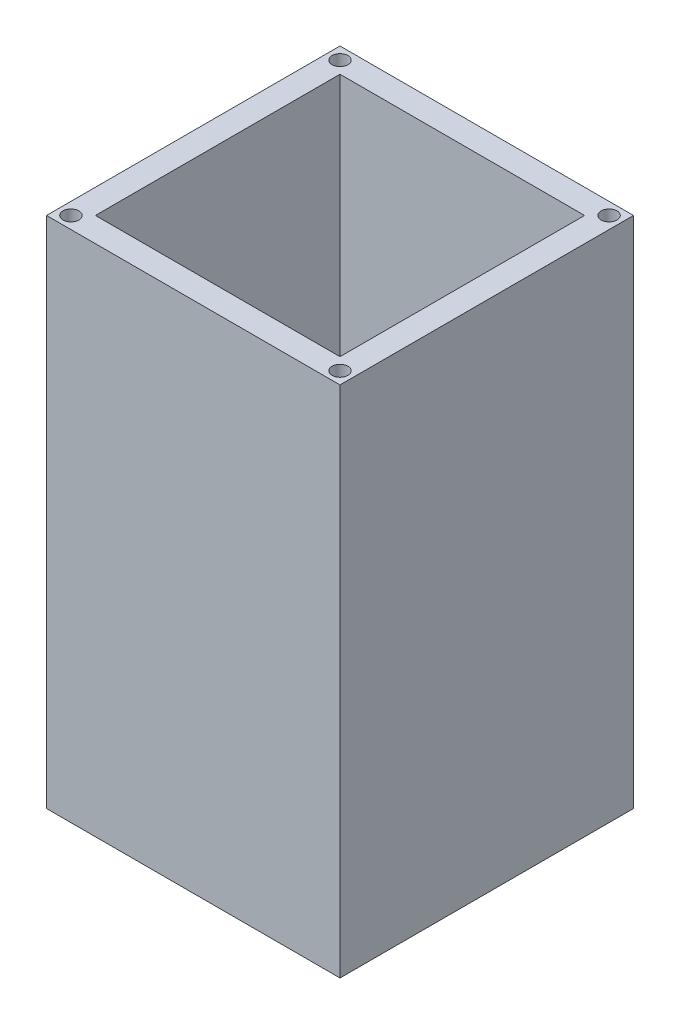
ISO-10303-21;
HEADER;
FILE_DESCRIPTION(('STEP AP214'),'2;1');
FILE_NAME('part.step','',(''),(''),'','','');
FILE_SCHEMA(('AUTOMOTIVE_DESIGN { 1 0 10303 214 1 1 1 1 }'));
ENDSEC;
DATA;
#1=APPLICATION_CONTEXT('core data for automotive mechanical design processes');
#2=APPLICATION_PROTOCOL_DEFINITION('international standard','automotive_design',2000,#1);
#3=PRODUCT_CONTEXT('',#1,'mechanical');
#4=PRODUCT('Part','Part','',(#3));
#5=PRODUCT_RELATED_PRODUCT_CATEGORY('part','',(#4));
#6=PRODUCT_DEFINITION_FORMATION('','',#4);
#7=PRODUCT_DEFINITION_CONTEXT('part definition',#1,'design');
#8=PRODUCT_DEFINITION('design','',#6,#7);
#9=PRODUCT_DEFINITION_SHAPE('','',#8);
#10=(LENGTH_UNIT() NAMED_UNIT(*) SI_UNIT(.MILLI.,.METRE.));
#11=(NAMED_UNIT(*) PLANE_ANGLE_UNIT() SI_UNIT($,.RADIAN.));
#12=(NAMED_UNIT(*) SI_UNIT($,.STERADIAN.) SOLID_ANGLE_UNIT());
#13=UNCERTAINTY_MEASURE_WITH_UNIT(LENGTH_MEASURE(1.E-05),#10,'distance_accuracy_value','');
#14=(GEOMETRIC_REPRESENTATION_CONTEXT(3) GLOBAL_UNCERTAINTY_ASSIGNED_CONTEXT((#13)) GLOBAL_UNIT_ASSIGNED_CONTEXT((#10,
#11,#12)) REPRESENTATION_CONTEXT('',''));
#15=CARTESIAN_POINT('',(0.,0.,0.));
#16=DIRECTION('',(0.,0.,1.));
#17=DIRECTION('',(1.,0.,0.));
#18=AXIS2_PLACEMENT_3D('',#15,#16,#17);
#19=CARTESIAN_POINT('',(0.,10.,0.));
#20=DIRECTION('',(0.,-1.,0.));
#21=DIRECTION('',(0.,0.,-1.));
#22=AXIS2_PLACEMENT_3D('',#19,#20,#21);
#23=PLANE('',#22);
#24=CARTESIAN_POINT('',(60.,10.,-60.));
#25=DIRECTION('',(0.,1.,0.));
#26=DIRECTION('',(0.,0.,1.));
#27=AXIS2_PLACEMENT_3D('',#24,#25,#26);
#28=CIRCLE('',#27,7.50000000000001);
#29=CARTESIAN_POINT('',(60.,10.,-52.5));
#30=VERTEX_POINT('',#29);
#31=EDGE_CURVE('E315',#30,#30,#28,.T.);
#32=ORIENTED_EDGE('',*,*,#31,.F.);
#33=EDGE_LOOP('',(#32));
#34=FACE_BOUND('',#33,.T.);
#35=DIRECTION('',(0.,0.,1.));
#36=VECTOR('',#35,1.);
#37=CARTESIAN_POINT('',(10.,10.,-110.));
#38=LINE('',#37,#36);
#39=CARTESIAN_POINT('',(10.,10.,-110.));
#40=VERTEX_POINT('',#39);
#41=CARTESIAN_POINT('',(10.,10.,-10.));
#42=VERTEX_POINT('',#41);
#43=EDGE_CURVE('E290',#40,#42,#38,.T.);
#44=ORIENTED_EDGE('',*,*,#43,.T.);
#45=DIRECTION('',(1.,0.,0.));
#46=VECTOR('',#45,1.);
#47=CARTESIAN_POINT('',(10.,10.,-10.));
#48=LINE('',#47,#46);
#49=CARTESIAN_POINT('',(110.,10.,-10.));
#50=VERTEX_POINT('',#49);
#51=EDGE_CURVE('E259',#42,#50,#48,.T.);
#52=ORIENTED_EDGE('',*,*,#51,.T.);
#53=DIRECTION('',(0.,0.,-1.));
#54=VECTOR('',#53,1.);
#55=CARTESIAN_POINT('',(110.,10.,-10.));
#56=LINE('',#55,#54);
#57=CARTESIAN_POINT('',(110.,10.,-110.));
#58=VERTEX_POINT('',#57);
#59=EDGE_CURVE('E205',#50,#58,#56,.T.);
#60=ORIENTED_EDGE('',*,*,#59,.T.);
#61=DIRECTION('',(-1.,0.,0.));
#62=VECTOR('',#61,1.);
#63=CARTESIAN_POINT('',(110.,10.,-110.));
#64=LINE('',#63,#62);
#65=EDGE_CURVE('E200',#58,#40,#64,.T.);
#66=ORIENTED_EDGE('',*,*,#65,.T.);
#67=EDGE_LOOP('',(#44,#52,#60,#66));
#68=FACE_BOUND('',#67,.T.);
#69=ADVANCED_FACE('F184',(#34,#68),#23,.F.);
#70=CARTESIAN_POINT('',(0.,0.,0.));
#71=DIRECTION('',(0.,-1.,0.));
#72=DIRECTION('',(0.,0.,-1.));
#73=AXIS2_PLACEMENT_3D('',#70,#71,#72);
#74=PLANE('',#73);
#75=DIRECTION('',(0.,0.,1.));
#76=VECTOR('',#75,1.);
#77=CARTESIAN_POINT('',(0.,0.,0.));
#78=LINE('',#77,#76);
#79=CARTESIAN_POINT('',(0.,0.,-120.));
#80=VERTEX_POINT('',#79);
#81=CARTESIAN_POINT('',(0.,0.,0.));
#82=VERTEX_POINT('',#81);
#83=EDGE_CURVE('E318',#80,#82,#78,.T.);
#84=ORIENTED_EDGE('',*,*,#83,.F.);
#85=DIRECTION('',(-1.,0.,0.));
#86=VECTOR('',#85,1.);
#87=CARTESIAN_POINT('',(0.,0.,-120.));
#88=LINE('',#87,#86);
#89=CARTESIAN_POINT('',(120.,0.,-120.));
#90=VERTEX_POINT('',#89);
#91=EDGE_CURVE('E327',#90,#80,#88,.T.);
#92=ORIENTED_EDGE('',*,*,#91,.F.);
#93=DIRECTION('',(0.,0.,-1.));
#94=VECTOR('',#93,1.);
#95=CARTESIAN_POINT('',(120.,0.,0.));
#96=LINE('',#95,#94);
#97=CARTESIAN_POINT('',(120.,0.,0.));
#98=VERTEX_POINT('',#97);
#99=EDGE_CURVE('E325',#98,#90,#96,.T.);
#100=ORIENTED_EDGE('',*,*,#99,.F.);
#101=DIRECTION('',(1.,0.,0.));
#102=VECTOR('',#101,1.);
#103=CARTESIAN_POINT('',(0.,0.,0.));
#104=LINE('',#103,#102);
#105=EDGE_CURVE('E323',#82,#98,#104,.T.);
#106=ORIENTED_EDGE('',*,*,#105,.F.);
#107=EDGE_LOOP('',(#84,#92,#100,#106));
#108=FACE_BOUND('',#107,.T.);
#109=CARTESIAN_POINT('',(60.,0.,-60.));
#110=DIRECTION('',(0.,1.,0.));
#111=DIRECTION('',(0.,0.,1.));
#112=AXIS2_PLACEMENT_3D('',#109,#110,#111);
#113=CIRCLE('',#112,7.50000000000001);
#114=CARTESIAN_POINT('',(60.,0.,-52.5));
#115=VERTEX_POINT('',#114);
#116=EDGE_CURVE('E303',#115,#115,#113,.T.);
#117=ORIENTED_EDGE('',*,*,#116,.T.);
#118=EDGE_LOOP('',(#117));
#119=FACE_BOUND('',#118,.T.);
#120=ADVANCED_FACE('F351',(#108,#119),#74,.T.);
#121=CARTESIAN_POINT('',(0.,10.,0.));
#122=DIRECTION('',(1.,0.,0.));
#123=DIRECTION('',(0.,0.,-1.));
#124=AXIS2_PLACEMENT_3D('',#121,#122,#123);
#125=PLANE('',#124);
#126=ORIENTED_EDGE('',*,*,#83,.T.);
#127=DIRECTION('',(0.,-1.,0.));
#128=VECTOR('',#127,1.);
#129=CARTESIAN_POINT('',(0.,10.,0.));
#130=LINE('',#129,#128);
#131=CARTESIAN_POINT('',(0.,210.,0.));
#132=VERTEX_POINT('',#131);
#133=EDGE_CURVE('E14',#132,#82,#130,.T.);
#134=ORIENTED_EDGE('',*,*,#133,.F.);
#135=DIRECTION('',(0.,0.,1.));
#136=VECTOR('',#135,1.);
#137=CARTESIAN_POINT('',(0.,210.,-120.));
#138=LINE('',#137,#136);
#139=CARTESIAN_POINT('',(0.,210.,-120.));
#140=VERTEX_POINT('',#139);
#141=EDGE_CURVE('E304',#140,#132,#138,.T.);
#142=ORIENTED_EDGE('',*,*,#141,.F.);
#143=DIRECTION('',(0.,-1.,0.));
#144=VECTOR('',#143,1.);
#145=CARTESIAN_POINT('',(0.,10.,-120.));
#146=LINE('',#145,#144);
#147=EDGE_CURVE('E329',#140,#80,#146,.T.);
#148=ORIENTED_EDGE('',*,*,#147,.T.);
#149=EDGE_LOOP('',(#126,#134,#142,#148));
#150=FACE_BOUND('',#149,.T.);
#151=ADVANCED_FACE('F186',(#150),#125,.F.);
#152=CARTESIAN_POINT('',(0.,10.,0.));
#153=DIRECTION('',(0.,0.,-1.));
#154=DIRECTION('',(-1.,0.,0.));
#155=AXIS2_PLACEMENT_3D('',#152,#153,#154);
#156=PLANE('',#155);
#157=ORIENTED_EDGE('',*,*,#105,.T.);
#158=DIRECTION('',(0.,-1.,0.));
#159=VECTOR('',#158,1.);
#160=CARTESIAN_POINT('',(120.,10.,0.));
#161=LINE('',#160,#159);
#162=CARTESIAN_POINT('',(120.,210.,0.));
#163=VERTEX_POINT('',#162);
#164=EDGE_CURVE('E193',#163,#98,#161,.T.);
#165=ORIENTED_EDGE('',*,*,#164,.F.);
#166=DIRECTION('',(1.,0.,0.));
#167=VECTOR('',#166,1.);
#168=CARTESIAN_POINT('',(0.,210.,0.));
#169=LINE('',#168,#167);
#170=EDGE_CURVE('E297',#132,#163,#169,.T.);
#171=ORIENTED_EDGE('',*,*,#170,.F.);
#172=ORIENTED_EDGE('',*,*,#133,.T.);
#173=EDGE_LOOP('',(#157,#165,#171,#172));
#174=FACE_BOUND('',#173,.T.);
#175=ADVANCED_FACE('F358',(#174),#156,.F.);
#176=CARTESIAN_POINT('',(120.,10.,0.));
#177=DIRECTION('',(-1.,0.,0.));
#178=DIRECTION('',(0.,0.,1.));
#179=AXIS2_PLACEMENT_3D('',#176,#177,#178);
#180=PLANE('',#179);
#181=ORIENTED_EDGE('',*,*,#99,.T.);
#182=DIRECTION('',(0.,-1.,0.));
#183=VECTOR('',#182,1.);
#184=CARTESIAN_POINT('',(120.,10.,-120.));
#185=LINE('',#184,#183);
#186=CARTESIAN_POINT('',(120.,210.,-120.));
#187=VERTEX_POINT('',#186);
#188=EDGE_CURVE('E332',#187,#90,#185,.T.);
#189=ORIENTED_EDGE('',*,*,#188,.F.);
#190=DIRECTION('',(0.,0.,-1.));
#191=VECTOR('',#190,1.);
#192=CARTESIAN_POINT('',(120.,210.,0.));
#193=LINE('',#192,#191);
#194=EDGE_CURVE('E294',#163,#187,#193,.T.);
#195=ORIENTED_EDGE('',*,*,#194,.F.);
#196=ORIENTED_EDGE('',*,*,#164,.T.);
#197=EDGE_LOOP('',(#181,#189,#195,#196));
#198=FACE_BOUND('',#197,.T.);
#199=ADVANCED_FACE('F345',(#198),#180,.F.);
#200=CARTESIAN_POINT('',(0.,10.,-120.));
#201=DIRECTION('',(0.,0.,1.));
#202=DIRECTION('',(1.,0.,0.));
#203=AXIS2_PLACEMENT_3D('',#200,#201,#202);
#204=PLANE('',#203);
#205=ORIENTED_EDGE('',*,*,#91,.T.);
#206=ORIENTED_EDGE('',*,*,#147,.F.);
#207=DIRECTION('',(-1.,0.,0.));
#208=VECTOR('',#207,1.);
#209=CARTESIAN_POINT('',(120.,210.,-120.));
#210=LINE('',#209,#208);
#211=EDGE_CURVE('E300',#187,#140,#210,.T.);
#212=ORIENTED_EDGE('',*,*,#211,.F.);
#213=ORIENTED_EDGE('',*,*,#188,.T.);
#214=EDGE_LOOP('',(#205,#206,#212,#213));
#215=FACE_BOUND('',#214,.T.);
#216=ADVANCED_FACE('F354',(#215),#204,.F.);
#217=CARTESIAN_POINT('',(60.,10.,-60.));
#218=DIRECTION('',(0.,-1.,0.));
#219=DIRECTION('',(0.,0.,-1.));
#220=AXIS2_PLACEMENT_3D('',#217,#218,#219);
#221=CYLINDRICAL_SURFACE('',#220,7.50000000000001);
#222=ORIENTED_EDGE('',*,*,#31,.T.);
#223=EDGE_LOOP('',(#222));
#224=FACE_BOUND('',#223,.T.);
#225=ORIENTED_EDGE('',*,*,#116,.F.);
#226=EDGE_LOOP('',(#225));
#227=FACE_BOUND('',#226,.T.);
#228=ADVANCED_FACE('F374',(#224,#227),#221,.F.);
#229=CARTESIAN_POINT('',(0.,210.,0.));
#230=DIRECTION('',(0.,1.,0.));
#231=DIRECTION('',(0.,0.,1.));
#232=AXIS2_PLACEMENT_3D('',#229,#230,#231);
#233=PLANE('',#232);
#234=CARTESIAN_POINT('',(5.,210.,-115.));
#235=DIRECTION('',(0.,1.,0.));
#236=DIRECTION('',(0.,0.,1.));
#237=AXIS2_PLACEMENT_3D('',#234,#235,#236);
#238=CIRCLE('',#237,3.25000000000001);
#239=CARTESIAN_POINT('',(5.,210.,-111.75));
#240=VERTEX_POINT('',#239);
#241=EDGE_CURVE('E487',#240,#240,#238,.T.);
#242=ORIENTED_EDGE('',*,*,#241,.F.);
#243=EDGE_LOOP('',(#242));
#244=FACE_BOUND('',#243,.T.);
#245=CARTESIAN_POINT('',(115.,210.,-5.));
#246=DIRECTION('',(0.,1.,0.));
#247=DIRECTION('',(0.,0.,1.));
#248=AXIS2_PLACEMENT_3D('',#245,#246,#247);
#249=CIRCLE('',#248,3.25000000000001);
#250=CARTESIAN_POINT('',(115.,210.,-1.74999999999999));
#251=VERTEX_POINT('',#250);
#252=EDGE_CURVE('E474',#251,#251,#249,.T.);
#253=ORIENTED_EDGE('',*,*,#252,.F.);
#254=EDGE_LOOP('',(#253));
#255=FACE_BOUND('',#254,.T.);
#256=CARTESIAN_POINT('',(5.,210.,-5.));
#257=DIRECTION('',(0.,1.,0.));
#258=DIRECTION('',(0.,0.,1.));
#259=AXIS2_PLACEMENT_3D('',#256,#257,#258);
#260=CIRCLE('',#259,3.25000000000001);
#261=CARTESIAN_POINT('',(5.,210.,-1.74999999999999));
#262=VERTEX_POINT('',#261);
#263=EDGE_CURVE('E475',#262,#262,#260,.T.);
#264=ORIENTED_EDGE('',*,*,#263,.F.);
#265=EDGE_LOOP('',(#264));
#266=FACE_BOUND('',#265,.T.);
#267=CARTESIAN_POINT('',(115.,210.,-115.));
#268=DIRECTION('',(0.,1.,0.));
#269=DIRECTION('',(0.,0.,1.));
#270=AXIS2_PLACEMENT_3D('',#267,#268,#269);
#271=CIRCLE('',#270,3.25000000000001);
#272=CARTESIAN_POINT('',(115.,210.,-111.75));
#273=VERTEX_POINT('',#272);
#274=EDGE_CURVE('E486',#273,#273,#271,.T.);
#275=ORIENTED_EDGE('',*,*,#274,.F.);
#276=EDGE_LOOP('',(#275));
#277=FACE_BOUND('',#276,.T.);
#278=DIRECTION('',(0.,0.,1.));
#279=VECTOR('',#278,1.);
#280=CARTESIAN_POINT('',(10.,210.,-110.));
#281=LINE('',#280,#279);
#282=CARTESIAN_POINT('',(10.,210.,-110.));
#283=VERTEX_POINT('',#282);
#284=CARTESIAN_POINT('',(10.,210.,-10.));
#285=VERTEX_POINT('',#284);
#286=EDGE_CURVE('E291',#283,#285,#281,.T.);
#287=ORIENTED_EDGE('',*,*,#286,.F.);
#288=DIRECTION('',(-1.,0.,0.));
#289=VECTOR('',#288,1.);
#290=CARTESIAN_POINT('',(110.,210.,-110.));
#291=LINE('',#290,#289);
#292=CARTESIAN_POINT('',(110.,210.,-110.));
#293=VERTEX_POINT('',#292);
#294=EDGE_CURVE('E270',#293,#283,#291,.T.);
#295=ORIENTED_EDGE('',*,*,#294,.F.);
#296=DIRECTION('',(0.,0.,-1.));
#297=VECTOR('',#296,1.);
#298=CARTESIAN_POINT('',(110.,210.,-10.));
#299=LINE('',#298,#297);
#300=CARTESIAN_POINT('',(110.,210.,-10.));
#301=VERTEX_POINT('',#300);
#302=EDGE_CURVE('E264',#301,#293,#299,.T.);
#303=ORIENTED_EDGE('',*,*,#302,.F.);
#304=DIRECTION('',(1.,0.,0.));
#305=VECTOR('',#304,1.);
#306=CARTESIAN_POINT('',(10.,210.,-10.));
#307=LINE('',#306,#305);
#308=EDGE_CURVE('E248',#285,#301,#307,.T.);
#309=ORIENTED_EDGE('',*,*,#308,.F.);
#310=EDGE_LOOP('',(#287,#295,#303,#309));
#311=FACE_BOUND('',#310,.T.);
#312=ORIENTED_EDGE('',*,*,#194,.T.);
#313=ORIENTED_EDGE('',*,*,#211,.T.);
#314=ORIENTED_EDGE('',*,*,#141,.T.);
#315=ORIENTED_EDGE('',*,*,#170,.T.);
#316=EDGE_LOOP('',(#312,#313,#314,#315));
#317=FACE_BOUND('',#316,.T.);
#318=ADVANCED_FACE('F268',(#244,#255,#266,#277,#311,#317),#233,.T.);
#319=CARTESIAN_POINT('',(10.,10.,-110.));
#320=DIRECTION('',(-1.,0.,0.));
#321=DIRECTION('',(0.,0.,1.));
#322=AXIS2_PLACEMENT_3D('',#319,#320,#321);
#323=PLANE('',#322);
#324=ORIENTED_EDGE('',*,*,#286,.T.);
#325=DIRECTION('',(0.,1.,0.));
#326=VECTOR('',#325,1.);
#327=CARTESIAN_POINT('',(10.,10.,-10.));
#328=LINE('',#327,#326);
#329=EDGE_CURVE('E254',#42,#285,#328,.T.);
#330=ORIENTED_EDGE('',*,*,#329,.F.);
#331=ORIENTED_EDGE('',*,*,#43,.F.);
#332=DIRECTION('',(0.,1.,0.));
#333=VECTOR('',#332,1.);
#334=CARTESIAN_POINT('',(10.,10.,-110.));
#335=LINE('',#334,#333);
#336=EDGE_CURVE('E287',#40,#283,#335,.T.);
#337=ORIENTED_EDGE('',*,*,#336,.T.);
#338=EDGE_LOOP('',(#324,#330,#331,#337));
#339=FACE_BOUND('',#338,.T.);
#340=ADVANCED_FACE('F416',(#339),#323,.F.);
#341=CARTESIAN_POINT('',(110.,10.,-110.));
#342=DIRECTION('',(0.,0.,-1.));
#343=DIRECTION('',(-1.,0.,0.));
#344=AXIS2_PLACEMENT_3D('',#341,#342,#343);
#345=PLANE('',#344);
#346=ORIENTED_EDGE('',*,*,#294,.T.);
#347=ORIENTED_EDGE('',*,*,#336,.F.);
#348=ORIENTED_EDGE('',*,*,#65,.F.);
#349=DIRECTION('',(0.,1.,0.));
#350=VECTOR('',#349,1.);
#351=CARTESIAN_POINT('',(110.,10.,-110.));
#352=LINE('',#351,#350);
#353=EDGE_CURVE('E272',#58,#293,#352,.T.);
#354=ORIENTED_EDGE('',*,*,#353,.T.);
#355=EDGE_LOOP('',(#346,#347,#348,#354));
#356=FACE_BOUND('',#355,.T.);
#357=ADVANCED_FACE('F423',(#356),#345,.F.);
#358=CARTESIAN_POINT('',(110.,10.,-10.));
#359=DIRECTION('',(1.,0.,0.));
#360=DIRECTION('',(0.,0.,-1.));
#361=AXIS2_PLACEMENT_3D('',#358,#359,#360);
#362=PLANE('',#361);
#363=ORIENTED_EDGE('',*,*,#302,.T.);
#364=ORIENTED_EDGE('',*,*,#353,.F.);
#365=ORIENTED_EDGE('',*,*,#59,.F.);
#366=DIRECTION('',(0.,1.,0.));
#367=VECTOR('',#366,1.);
#368=CARTESIAN_POINT('',(110.,10.,-10.));
#369=LINE('',#368,#367);
#370=EDGE_CURVE('E252',#50,#301,#369,.T.);
#371=ORIENTED_EDGE('',*,*,#370,.T.);
#372=EDGE_LOOP('',(#363,#364,#365,#371));
#373=FACE_BOUND('',#372,.T.);
#374=ADVANCED_FACE('F262',(#373),#362,.F.);
#375=CARTESIAN_POINT('',(10.,10.,-10.));
#376=DIRECTION('',(0.,0.,1.));
#377=DIRECTION('',(1.,0.,0.));
#378=AXIS2_PLACEMENT_3D('',#375,#376,#377);
#379=PLANE('',#378);
#380=ORIENTED_EDGE('',*,*,#308,.T.);
#381=ORIENTED_EDGE('',*,*,#370,.F.);
#382=ORIENTED_EDGE('',*,*,#51,.F.);
#383=ORIENTED_EDGE('',*,*,#329,.T.);
#384=EDGE_LOOP('',(#380,#381,#382,#383));
#385=FACE_BOUND('',#384,.T.);
#386=ADVANCED_FACE('F250',(#385),#379,.F.);
#387=CARTESIAN_POINT('',(115.,195.,-115.));
#388=DIRECTION('',(0.,1.,0.));
#389=DIRECTION('',(0.,0.,1.));
#390=AXIS2_PLACEMENT_3D('',#387,#388,#389);
#391=CYLINDRICAL_SURFACE('',#390,3.25000000000001);
#392=CARTESIAN_POINT('',(115.,195.,-115.));
#393=DIRECTION('',(0.,1.,0.));
#394=DIRECTION('',(0.,0.,1.));
#395=AXIS2_PLACEMENT_3D('',#392,#393,#394);
#396=CIRCLE('',#395,3.25000000000001);
#397=CARTESIAN_POINT('',(115.,195.,-111.75));
#398=VERTEX_POINT('',#397);
#399=EDGE_CURVE('E492',#398,#398,#396,.T.);
#400=ORIENTED_EDGE('',*,*,#399,.F.);
#401=EDGE_LOOP('',(#400));
#402=FACE_BOUND('',#401,.T.);
#403=ORIENTED_EDGE('',*,*,#274,.T.);
#404=EDGE_LOOP('',(#403));
#405=FACE_BOUND('',#404,.T.);
#406=ADVANCED_FACE('F426',(#402,#405),#391,.F.);
#407=CARTESIAN_POINT('',(115.,195.,-115.));
#408=DIRECTION('',(0.,1.,0.));
#409=DIRECTION('',(0.,0.,1.));
#410=AXIS2_PLACEMENT_3D('',#407,#408,#409);
#411=PLANE('',#410);
#412=ORIENTED_EDGE('',*,*,#399,.T.);
#413=EDGE_LOOP('',(#412));
#414=FACE_BOUND('',#413,.T.);
#415=ADVANCED_FACE('F435',(#414),#411,.T.);
#416=CARTESIAN_POINT('',(5.,195.,-5.));
#417=DIRECTION('',(0.,1.,0.));
#418=DIRECTION('',(0.,0.,1.));
#419=AXIS2_PLACEMENT_3D('',#416,#417,#418);
#420=CYLINDRICAL_SURFACE('',#419,3.25000000000001);
#421=CARTESIAN_POINT('',(5.,195.,-5.));
#422=DIRECTION('',(0.,1.,0.));
#423=DIRECTION('',(0.,0.,1.));
#424=AXIS2_PLACEMENT_3D('',#421,#422,#423);
#425=CIRCLE('',#424,3.25000000000001);
#426=CARTESIAN_POINT('',(5.,195.,-1.74999999999999));
#427=VERTEX_POINT('',#426);
#428=EDGE_CURVE('E473',#427,#427,#425,.T.);
#429=ORIENTED_EDGE('',*,*,#428,.F.);
#430=EDGE_LOOP('',(#429));
#431=FACE_BOUND('',#430,.T.);
#432=ORIENTED_EDGE('',*,*,#263,.T.);
#433=EDGE_LOOP('',(#432));
#434=FACE_BOUND('',#433,.T.);
#435=ADVANCED_FACE('F445',(#431,#434),#420,.F.);
#436=CARTESIAN_POINT('',(5.,195.,-5.));
#437=DIRECTION('',(0.,1.,0.));
#438=DIRECTION('',(0.,0.,1.));
#439=AXIS2_PLACEMENT_3D('',#436,#437,#438);
#440=PLANE('',#439);
#441=ORIENTED_EDGE('',*,*,#428,.T.);
#442=EDGE_LOOP('',(#441));
#443=FACE_BOUND('',#442,.T.);
#444=ADVANCED_FACE('F451',(#443),#440,.T.);
#445=CARTESIAN_POINT('',(115.,195.,-5.));
#446=DIRECTION('',(0.,1.,0.));
#447=DIRECTION('',(0.,0.,1.));
#448=AXIS2_PLACEMENT_3D('',#445,#446,#447);
#449=CYLINDRICAL_SURFACE('',#448,3.25000000000001);
#450=CARTESIAN_POINT('',(115.,195.,-5.));
#451=DIRECTION('',(0.,1.,0.));
#452=DIRECTION('',(0.,0.,1.));
#453=AXIS2_PLACEMENT_3D('',#450,#451,#452);
#454=CIRCLE('',#453,3.25000000000001);
#455=CARTESIAN_POINT('',(115.,195.,-1.74999999999999));
#456=VERTEX_POINT('',#455);
#457=EDGE_CURVE('E478',#456,#456,#454,.T.);
#458=ORIENTED_EDGE('',*,*,#457,.F.);
#459=EDGE_LOOP('',(#458));
#460=FACE_BOUND('',#459,.T.);
#461=ORIENTED_EDGE('',*,*,#252,.T.);
#462=EDGE_LOOP('',(#461));
#463=FACE_BOUND('',#462,.T.);
#464=ADVANCED_FACE('F447',(#460,#463),#449,.F.);
#465=CARTESIAN_POINT('',(115.,195.,-5.));
#466=DIRECTION('',(0.,1.,0.));
#467=DIRECTION('',(0.,0.,1.));
#468=AXIS2_PLACEMENT_3D('',#465,#466,#467);
#469=PLANE('',#468);
#470=ORIENTED_EDGE('',*,*,#457,.T.);
#471=EDGE_LOOP('',(#470));
#472=FACE_BOUND('',#471,.T.);
#473=ADVANCED_FACE('F450',(#472),#469,.T.);
#474=CARTESIAN_POINT('',(5.,195.,-115.));
#475=DIRECTION('',(0.,1.,0.));
#476=DIRECTION('',(0.,0.,1.));
#477=AXIS2_PLACEMENT_3D('',#474,#475,#476);
#478=CYLINDRICAL_SURFACE('',#477,3.25000000000001);
#479=CARTESIAN_POINT('',(5.,195.,-115.));
#480=DIRECTION('',(0.,1.,0.));
#481=DIRECTION('',(0.,0.,1.));
#482=AXIS2_PLACEMENT_3D('',#479,#480,#481);
#483=CIRCLE('',#482,3.25000000000001);
#484=CARTESIAN_POINT('',(5.,195.,-111.75));
#485=VERTEX_POINT('',#484);
#486=EDGE_CURVE('E483',#485,#485,#483,.T.);
#487=ORIENTED_EDGE('',*,*,#486,.F.);
#488=EDGE_LOOP('',(#487));
#489=FACE_BOUND('',#488,.T.);
#490=ORIENTED_EDGE('',*,*,#241,.T.);
#491=EDGE_LOOP('',(#490));
#492=FACE_BOUND('',#491,.T.);
#493=ADVANCED_FACE('F455',(#489,#492),#478,.F.);
#494=CARTESIAN_POINT('',(5.,195.,-115.));
#495=DIRECTION('',(0.,1.,0.));
#496=DIRECTION('',(0.,0.,1.));
#497=AXIS2_PLACEMENT_3D('',#494,#495,#496);
#498=PLANE('',#497);
#499=ORIENTED_EDGE('',*,*,#486,.T.);
#500=EDGE_LOOP('',(#499));
#501=FACE_BOUND('',#500,.T.);
#502=ADVANCED_FACE('F459',(#501),#498,.T.);
#503=CLOSED_SHELL('',(#69,#120,#151,#175,#199,#216,#228,#318,#340,#357,#374,#386,#406,#415,#435,
#444,#464,#473,#493,#502));
#504=MANIFOLD_SOLID_BREP('B2',#503);
#505=ADVANCED_BREP_SHAPE_REPRESENTATION('',(#18,#504),#14);
#506=SHAPE_DEFINITION_REPRESENTATION(#9,#505);
ENDSEC;
END-ISO-10303-21;
